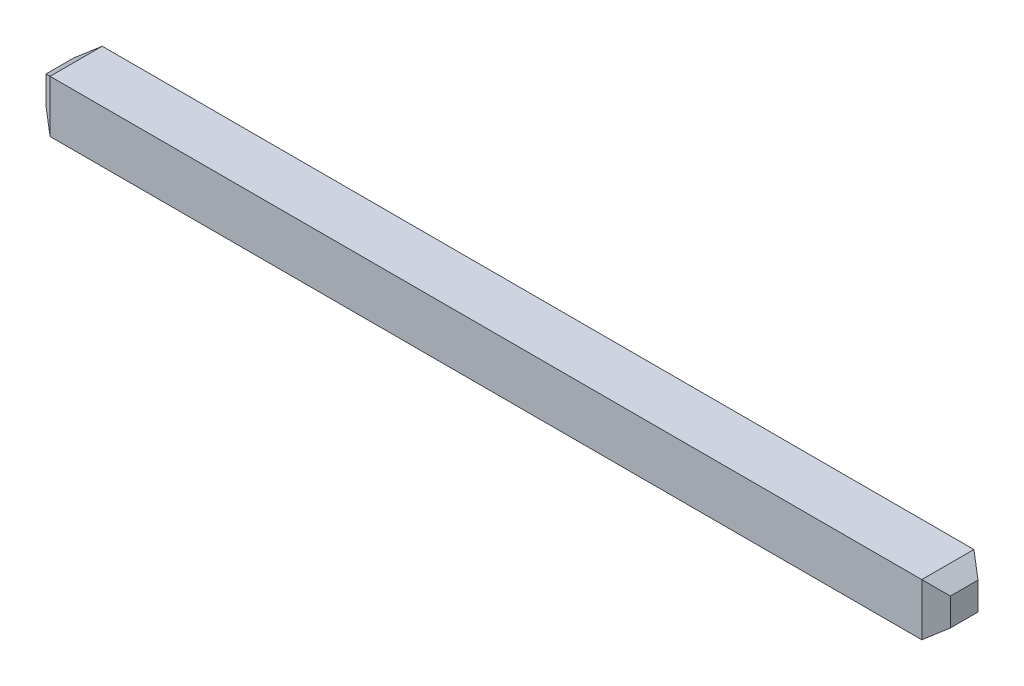
ISO-10303-21;
HEADER;
FILE_DESCRIPTION(('STEP AP214'),'2;1');
FILE_NAME('part.step','',(''),(''),'','','');
FILE_SCHEMA(('AUTOMOTIVE_DESIGN { 1 0 10303 214 1 1 1 1 }'));
ENDSEC;
DATA;
#1=APPLICATION_CONTEXT('core data for automotive mechanical design processes');
#2=APPLICATION_PROTOCOL_DEFINITION('international standard','automotive_design',2000,#1);
#3=PRODUCT_CONTEXT('',#1,'mechanical');
#4=PRODUCT('Part','Part','',(#3));
#5=PRODUCT_RELATED_PRODUCT_CATEGORY('part','',(#4));
#6=PRODUCT_DEFINITION_FORMATION('','',#4);
#7=PRODUCT_DEFINITION_CONTEXT('part definition',#1,'design');
#8=PRODUCT_DEFINITION('design','',#6,#7);
#9=PRODUCT_DEFINITION_SHAPE('','',#8);
#10=(LENGTH_UNIT() NAMED_UNIT(*) SI_UNIT(.MILLI.,.METRE.));
#11=(NAMED_UNIT(*) PLANE_ANGLE_UNIT() SI_UNIT($,.RADIAN.));
#12=(NAMED_UNIT(*) SI_UNIT($,.STERADIAN.) SOLID_ANGLE_UNIT());
#13=UNCERTAINTY_MEASURE_WITH_UNIT(LENGTH_MEASURE(1.E-05),#10,'distance_accuracy_value','');
#14=(GEOMETRIC_REPRESENTATION_CONTEXT(3) GLOBAL_UNCERTAINTY_ASSIGNED_CONTEXT((#13)) GLOBAL_UNIT_ASSIGNED_CONTEXT((#10,
#11,#12)) REPRESENTATION_CONTEXT('',''));
#15=CARTESIAN_POINT('',(0.,0.,0.));
#16=DIRECTION('',(0.,0.,1.));
#17=DIRECTION('',(1.,0.,0.));
#18=AXIS2_PLACEMENT_3D('',#15,#16,#17);
#19=CARTESIAN_POINT('',(-2.4,1.23,-49.775));
#20=DIRECTION('',(0.599999999990736,0.,0.800000000006948));
#21=DIRECTION('',(0.800000000006948,0.,-0.599999999990736));
#22=AXIS2_PLACEMENT_3D('',#19,#20,#21);
#23=PLANE('',#22);
#24=DIRECTION('',(0.,1.,0.));
#25=VECTOR('',#24,1.);
#26=CARTESIAN_POINT('',(-2.3,1.23,-49.85));
#27=LINE('',#26,#25);
#28=CARTESIAN_POINT('',(-2.29999999999956,1.55,-49.8499999999994));
#29=VERTEX_POINT('',#28);
#30=CARTESIAN_POINT('',(-2.29999999999957,0.909999999999898,-49.8499999999994));
#31=VERTEX_POINT('',#30);
#32=EDGE_CURVE('E101',#29,#31,#27,.F.);
#33=ORIENTED_EDGE('',*,*,#32,.T.);
#34=DIRECTION('',(-0.685994340569487,0.514495755428337,0.514495755427447));
#35=VECTOR('',#34,1.);
#36=CARTESIAN_POINT('',(-2.30000000000009,0.909999999999786,-49.85));
#37=LINE('',#36,#35);
#38=CARTESIAN_POINT('',(-2.50000000000021,1.06000000000001,-49.7000000000003));
#39=VERTEX_POINT('',#38);
#40=EDGE_CURVE('E85',#31,#39,#37,.T.);
#41=ORIENTED_EDGE('',*,*,#40,.T.);
#42=DIRECTION('',(0.,1.,0.));
#43=VECTOR('',#42,1.);
#44=CARTESIAN_POINT('',(-2.5,1.23,-49.7));
#45=LINE('',#44,#43);
#46=CARTESIAN_POINT('',(-2.50000000000043,1.4,-49.7000000000006));
#47=VERTEX_POINT('',#46);
#48=EDGE_CURVE('E79',#39,#47,#45,.T.);
#49=ORIENTED_EDGE('',*,*,#48,.T.);
#50=DIRECTION('',(-0.68599434057003,-0.514495755427523,0.514495755427537));
#51=VECTOR('',#50,1.);
#52=CARTESIAN_POINT('',(-2.3,1.55,-49.85));
#53=LINE('',#52,#51);
#54=EDGE_CURVE('E20',#29,#47,#53,.T.);
#55=ORIENTED_EDGE('',*,*,#54,.F.);
#56=EDGE_LOOP('',(#33,#41,#49,#55));
#57=FACE_BOUND('',#56,.T.);
#58=ADVANCED_FACE('F17',(#57),#23,.F.);
#59=CARTESIAN_POINT('',(8.5,1.23,-49.775));
#60=DIRECTION('',(-0.599999999990736,0.,0.800000000006948));
#61=DIRECTION('',(0.800000000006948,0.,0.599999999990736));
#62=AXIS2_PLACEMENT_3D('',#59,#60,#61);
#63=PLANE('',#62);
#64=DIRECTION('',(0.,1.,0.));
#65=VECTOR('',#64,1.);
#66=CARTESIAN_POINT('',(8.6,1.23,-49.7));
#67=LINE('',#66,#65);
#68=CARTESIAN_POINT('',(8.6000000000002,1.06000000000003,-49.7000000000003));
#69=VERTEX_POINT('',#68);
#70=CARTESIAN_POINT('',(8.60000000000043,1.4,-49.7000000000006));
#71=VERTEX_POINT('',#70);
#72=EDGE_CURVE('E113',#69,#71,#67,.T.);
#73=ORIENTED_EDGE('',*,*,#72,.F.);
#74=DIRECTION('',(-0.685994340569488,-0.514495755428337,-0.514495755427446));
#75=VECTOR('',#74,1.);
#76=CARTESIAN_POINT('',(8.59999999999996,1.06000000000005,-49.7));
#77=LINE('',#76,#75);
#78=CARTESIAN_POINT('',(8.39999999999958,0.909999999999884,-49.8499999999994));
#79=VERTEX_POINT('',#78);
#80=EDGE_CURVE('E108',#69,#79,#77,.T.);
#81=ORIENTED_EDGE('',*,*,#80,.T.);
#82=DIRECTION('',(0.,1.,0.));
#83=VECTOR('',#82,1.);
#84=CARTESIAN_POINT('',(8.4,1.23,-49.85));
#85=LINE('',#84,#83);
#86=CARTESIAN_POINT('',(8.39999999999956,1.55,-49.8499999999994));
#87=VERTEX_POINT('',#86);
#88=EDGE_CURVE('E99',#79,#87,#85,.T.);
#89=ORIENTED_EDGE('',*,*,#88,.T.);
#90=DIRECTION('',(-0.685994340570029,0.514495755427522,-0.51449575542754));
#91=VECTOR('',#90,1.);
#92=CARTESIAN_POINT('',(8.6,1.4,-49.7));
#93=LINE('',#92,#91);
#94=EDGE_CURVE('E116',#71,#87,#93,.T.);
#95=ORIENTED_EDGE('',*,*,#94,.F.);
#96=EDGE_LOOP('',(#73,#81,#89,#95));
#97=FACE_BOUND('',#96,.T.);
#98=ADVANCED_FACE('F214',(#97),#63,.F.);
#99=CARTESIAN_POINT('',(-2.4,1.475,-49.53));
#100=DIRECTION('',(-0.6,0.8,0.));
#101=DIRECTION('',(-0.8,-0.6,0.));
#102=AXIS2_PLACEMENT_3D('',#99,#100,#101);
#103=PLANE('',#102);
#104=DIRECTION('',(-0.685994340575951,-0.514495755427527,-0.514495755419639));
#105=VECTOR('',#104,1.);
#106=CARTESIAN_POINT('',(-2.29999999999914,1.55,-49.2100000000012));
#107=LINE('',#106,#105);
#108=CARTESIAN_POINT('',(-2.29999999999989,1.55,-49.2100000000001));
#109=VERTEX_POINT('',#108);
#110=CARTESIAN_POINT('',(-2.50000000000022,1.4,-49.3599999999997));
#111=VERTEX_POINT('',#110);
#112=EDGE_CURVE('E128',#109,#111,#107,.T.);
#113=ORIENTED_EDGE('',*,*,#112,.F.);
#114=DIRECTION('',(0.,0.,1.));
#115=VECTOR('',#114,1.);
#116=CARTESIAN_POINT('',(-2.3,1.55,-49.53));
#117=LINE('',#116,#115);
#118=EDGE_CURVE('E93',#29,#109,#117,.T.);
#119=ORIENTED_EDGE('',*,*,#118,.F.);
#120=ORIENTED_EDGE('',*,*,#54,.T.);
#121=DIRECTION('',(0.,0.,-1.));
#122=VECTOR('',#121,1.);
#123=CARTESIAN_POINT('',(-2.5,1.4,-49.53));
#124=LINE('',#123,#122);
#125=EDGE_CURVE('E87',#47,#111,#124,.F.);
#126=ORIENTED_EDGE('',*,*,#125,.T.);
#127=EDGE_LOOP('',(#113,#119,#120,#126));
#128=FACE_BOUND('',#127,.T.);
#129=ADVANCED_FACE('F90',(#128),#103,.T.);
#130=CARTESIAN_POINT('',(-2.5,1.23,-49.53));
#131=DIRECTION('',(1.,0.,0.));
#132=DIRECTION('',(0.,0.,-1.));
#133=AXIS2_PLACEMENT_3D('',#130,#131,#132);
#134=PLANE('',#133);
#135=DIRECTION('',(0.,1.,0.));
#136=VECTOR('',#135,1.);
#137=CARTESIAN_POINT('',(-2.50000000000087,1.23,-49.3599999999988));
#138=LINE('',#137,#136);
#139=CARTESIAN_POINT('',(-2.50000000000021,1.06000000000001,-49.3599999999997));
#140=VERTEX_POINT('',#139);
#141=EDGE_CURVE('E97',#111,#140,#138,.F.);
#142=ORIENTED_EDGE('',*,*,#141,.F.);
#143=ORIENTED_EDGE('',*,*,#125,.F.);
#144=ORIENTED_EDGE('',*,*,#48,.F.);
#145=DIRECTION('',(0.,0.,1.));
#146=VECTOR('',#145,1.);
#147=CARTESIAN_POINT('',(-2.49999999999996,1.06000000000005,-49.53));
#148=LINE('',#147,#146);
#149=EDGE_CURVE('E105',#39,#140,#148,.T.);
#150=ORIENTED_EDGE('',*,*,#149,.T.);
#151=EDGE_LOOP('',(#142,#143,#144,#150));
#152=FACE_BOUND('',#151,.T.);
#153=ADVANCED_FACE('F95',(#152),#134,.F.);
#154=CARTESIAN_POINT('',(3.05,1.23,-49.85));
#155=DIRECTION('',(0.,0.,1.));
#156=DIRECTION('',(1.,0.,0.));
#157=AXIS2_PLACEMENT_3D('',#154,#155,#156);
#158=PLANE('',#157);
#159=ORIENTED_EDGE('',*,*,#32,.F.);
#160=DIRECTION('',(1.,0.,0.));
#161=VECTOR('',#160,1.);
#162=CARTESIAN_POINT('',(3.05,1.55,-49.85));
#163=LINE('',#162,#161);
#164=EDGE_CURVE('E122',#87,#29,#163,.F.);
#165=ORIENTED_EDGE('',*,*,#164,.F.);
#166=ORIENTED_EDGE('',*,*,#88,.F.);
#167=DIRECTION('',(1.,0.,0.));
#168=VECTOR('',#167,1.);
#169=CARTESIAN_POINT('',(3.05,0.91,-49.85));
#170=LINE('',#169,#168);
#171=EDGE_CURVE('E136',#79,#31,#170,.F.);
#172=ORIENTED_EDGE('',*,*,#171,.T.);
#173=EDGE_LOOP('',(#159,#165,#166,#172));
#174=FACE_BOUND('',#173,.T.);
#175=ADVANCED_FACE('F182',(#174),#158,.F.);
#176=CARTESIAN_POINT('',(-2.4,0.9849999999999,-49.53));
#177=DIRECTION('',(0.600000000000912,0.799999999999316,0.));
#178=DIRECTION('',(-0.799999999999316,0.600000000000912,0.));
#179=AXIS2_PLACEMENT_3D('',#176,#177,#178);
#180=PLANE('',#179);
#181=DIRECTION('',(0.,0.,1.));
#182=VECTOR('',#181,1.);
#183=CARTESIAN_POINT('',(-2.3,0.91,-49.53));
#184=LINE('',#183,#182);
#185=CARTESIAN_POINT('',(-2.29999999999983,0.909999999999856,-49.2100000000003));
#186=VERTEX_POINT('',#185);
#187=EDGE_CURVE('E139',#31,#186,#184,.T.);
#188=ORIENTED_EDGE('',*,*,#187,.T.);
#189=DIRECTION('',(0.68599434057583,-0.514495755427779,0.514495755419548));
#190=VECTOR('',#189,1.);
#191=CARTESIAN_POINT('',(-2.50000000000087,1.06,-49.3599999999988));
#192=LINE('',#191,#190);
#193=EDGE_CURVE('E131',#140,#186,#192,.T.);
#194=ORIENTED_EDGE('',*,*,#193,.F.);
#195=ORIENTED_EDGE('',*,*,#149,.F.);
#196=ORIENTED_EDGE('',*,*,#40,.F.);
#197=EDGE_LOOP('',(#188,#194,#195,#196));
#198=FACE_BOUND('',#197,.T.);
#199=ADVANCED_FACE('F179',(#198),#180,.F.);
#200=CARTESIAN_POINT('',(8.5,0.9849999999999,-49.53));
#201=DIRECTION('',(-0.600000000000912,0.799999999999316,0.));
#202=DIRECTION('',(-0.799999999999316,-0.600000000000912,0.));
#203=AXIS2_PLACEMENT_3D('',#200,#201,#202);
#204=PLANE('',#203);
#205=DIRECTION('',(0.,0.,-1.));
#206=VECTOR('',#205,1.);
#207=CARTESIAN_POINT('',(8.6,1.06,-49.53));
#208=LINE('',#207,#206);
#209=CARTESIAN_POINT('',(8.6000000000002,1.06000000000003,-49.3599999999997));
#210=VERTEX_POINT('',#209);
#211=EDGE_CURVE('E110',#210,#69,#208,.T.);
#212=ORIENTED_EDGE('',*,*,#211,.F.);
#213=DIRECTION('',(0.68599434057583,0.514495755427779,-0.514495755419548));
#214=VECTOR('',#213,1.);
#215=CARTESIAN_POINT('',(8.39999999999914,0.9099999999999,-49.2100000000012));
#216=LINE('',#215,#214);
#217=CARTESIAN_POINT('',(8.39999999999993,0.909999999999868,-49.2100000000001));
#218=VERTEX_POINT('',#217);
#219=EDGE_CURVE('E35',#218,#210,#216,.T.);
#220=ORIENTED_EDGE('',*,*,#219,.F.);
#221=DIRECTION('',(0.,0.,1.));
#222=VECTOR('',#221,1.);
#223=CARTESIAN_POINT('',(8.4,0.91,-49.53));
#224=LINE('',#223,#222);
#225=EDGE_CURVE('E134',#218,#79,#224,.F.);
#226=ORIENTED_EDGE('',*,*,#225,.T.);
#227=ORIENTED_EDGE('',*,*,#80,.F.);
#228=EDGE_LOOP('',(#212,#220,#226,#227));
#229=FACE_BOUND('',#228,.T.);
#230=ADVANCED_FACE('F181',(#229),#204,.F.);
#231=CARTESIAN_POINT('',(8.6,1.23,-49.53));
#232=DIRECTION('',(1.,0.,0.));
#233=DIRECTION('',(0.,0.,-1.));
#234=AXIS2_PLACEMENT_3D('',#231,#232,#233);
#235=PLANE('',#234);
#236=ORIENTED_EDGE('',*,*,#72,.T.);
#237=DIRECTION('',(0.,0.,1.));
#238=VECTOR('',#237,1.);
#239=CARTESIAN_POINT('',(8.6,1.4,-49.53));
#240=LINE('',#239,#238);
#241=CARTESIAN_POINT('',(8.60000000000022,1.4,-49.3599999999997));
#242=VERTEX_POINT('',#241);
#243=EDGE_CURVE('E119',#242,#71,#240,.F.);
#244=ORIENTED_EDGE('',*,*,#243,.F.);
#245=DIRECTION('',(0.,1.,0.));
#246=VECTOR('',#245,1.);
#247=CARTESIAN_POINT('',(8.60000000000087,1.23,-49.3599999999988));
#248=LINE('',#247,#246);
#249=EDGE_CURVE('E142',#210,#242,#248,.T.);
#250=ORIENTED_EDGE('',*,*,#249,.F.);
#251=ORIENTED_EDGE('',*,*,#211,.T.);
#252=EDGE_LOOP('',(#236,#244,#250,#251));
#253=FACE_BOUND('',#252,.T.);
#254=ADVANCED_FACE('F189',(#253),#235,.T.);
#255=CARTESIAN_POINT('',(8.5,1.475,-49.53));
#256=DIRECTION('',(0.6,0.8,0.));
#257=DIRECTION('',(-0.8,0.6,0.));
#258=AXIS2_PLACEMENT_3D('',#255,#256,#257);
#259=PLANE('',#258);
#260=DIRECTION('',(-0.685994340575951,0.514495755427527,0.514495755419639));
#261=VECTOR('',#260,1.);
#262=CARTESIAN_POINT('',(8.60000000000087,1.4,-49.3599999999988));
#263=LINE('',#262,#261);
#264=CARTESIAN_POINT('',(8.39999999999989,1.55,-49.2100000000001));
#265=VERTEX_POINT('',#264);
#266=EDGE_CURVE('E145',#242,#265,#263,.T.);
#267=ORIENTED_EDGE('',*,*,#266,.F.);
#268=ORIENTED_EDGE('',*,*,#243,.T.);
#269=ORIENTED_EDGE('',*,*,#94,.T.);
#270=DIRECTION('',(0.,0.,1.));
#271=VECTOR('',#270,1.);
#272=CARTESIAN_POINT('',(8.4,1.55,-49.53));
#273=LINE('',#272,#271);
#274=EDGE_CURVE('E125',#265,#87,#273,.F.);
#275=ORIENTED_EDGE('',*,*,#274,.F.);
#276=EDGE_LOOP('',(#267,#268,#269,#275));
#277=FACE_BOUND('',#276,.T.);
#278=ADVANCED_FACE('F170',(#277),#259,.T.);
#279=CARTESIAN_POINT('',(3.05,1.55,-49.53));
#280=DIRECTION('',(0.,1.,0.));
#281=DIRECTION('',(0.,0.,1.));
#282=AXIS2_PLACEMENT_3D('',#279,#280,#281);
#283=PLANE('',#282);
#284=DIRECTION('',(1.,0.,0.));
#285=VECTOR('',#284,1.);
#286=CARTESIAN_POINT('',(3.05,1.55,-49.21));
#287=LINE('',#286,#285);
#288=EDGE_CURVE('E148',#265,#109,#287,.F.);
#289=ORIENTED_EDGE('',*,*,#288,.F.);
#290=ORIENTED_EDGE('',*,*,#274,.T.);
#291=ORIENTED_EDGE('',*,*,#164,.T.);
#292=ORIENTED_EDGE('',*,*,#118,.T.);
#293=EDGE_LOOP('',(#289,#290,#291,#292));
#294=FACE_BOUND('',#293,.T.);
#295=ADVANCED_FACE('F173',(#294),#283,.T.);
#296=CARTESIAN_POINT('',(-2.4,1.23,-49.285));
#297=DIRECTION('',(-0.5999999999908,0.,0.8000000000069));
#298=DIRECTION('',(0.8000000000069,0.,0.5999999999908));
#299=AXIS2_PLACEMENT_3D('',#296,#297,#298);
#300=PLANE('',#299);
#301=ORIENTED_EDGE('',*,*,#193,.T.);
#302=DIRECTION('',(0.,1.,0.));
#303=VECTOR('',#302,1.);
#304=CARTESIAN_POINT('',(-2.3,1.23,-49.21));
#305=LINE('',#304,#303);
#306=EDGE_CURVE('E151',#109,#186,#305,.F.);
#307=ORIENTED_EDGE('',*,*,#306,.F.);
#308=ORIENTED_EDGE('',*,*,#112,.T.);
#309=ORIENTED_EDGE('',*,*,#141,.T.);
#310=EDGE_LOOP('',(#301,#307,#308,#309));
#311=FACE_BOUND('',#310,.T.);
#312=ADVANCED_FACE('F176',(#311),#300,.T.);
#313=CARTESIAN_POINT('',(3.05,0.91,-49.53));
#314=DIRECTION('',(0.,1.,0.));
#315=DIRECTION('',(0.,0.,1.));
#316=AXIS2_PLACEMENT_3D('',#313,#314,#315);
#317=PLANE('',#316);
#318=ORIENTED_EDGE('',*,*,#187,.F.);
#319=ORIENTED_EDGE('',*,*,#171,.F.);
#320=ORIENTED_EDGE('',*,*,#225,.F.);
#321=DIRECTION('',(1.,0.,0.));
#322=VECTOR('',#321,1.);
#323=CARTESIAN_POINT('',(3.05,0.9099999999999,-49.21));
#324=LINE('',#323,#322);
#325=EDGE_CURVE('E26',#186,#218,#324,.T.);
#326=ORIENTED_EDGE('',*,*,#325,.F.);
#327=EDGE_LOOP('',(#318,#319,#320,#326));
#328=FACE_BOUND('',#327,.T.);
#329=ADVANCED_FACE('F162',(#328),#317,.F.);
#330=CARTESIAN_POINT('',(8.5,1.23,-49.285));
#331=DIRECTION('',(0.5999999999908,0.,0.8000000000069));
#332=DIRECTION('',(0.8000000000069,0.,-0.5999999999908));
#333=AXIS2_PLACEMENT_3D('',#330,#331,#332);
#334=PLANE('',#333);
#335=ORIENTED_EDGE('',*,*,#266,.T.);
#336=DIRECTION('',(0.,1.,0.));
#337=VECTOR('',#336,1.);
#338=CARTESIAN_POINT('',(8.4,1.23,-49.21));
#339=LINE('',#338,#337);
#340=EDGE_CURVE('E11',#218,#265,#339,.T.);
#341=ORIENTED_EDGE('',*,*,#340,.F.);
#342=ORIENTED_EDGE('',*,*,#219,.T.);
#343=ORIENTED_EDGE('',*,*,#249,.T.);
#344=EDGE_LOOP('',(#335,#341,#342,#343));
#345=FACE_BOUND('',#344,.T.);
#346=ADVANCED_FACE('F166',(#345),#334,.T.);
#347=CARTESIAN_POINT('',(3.05,1.23,-49.21));
#348=DIRECTION('',(0.,0.,1.));
#349=DIRECTION('',(1.,0.,0.));
#350=AXIS2_PLACEMENT_3D('',#347,#348,#349);
#351=PLANE('',#350);
#352=ORIENTED_EDGE('',*,*,#325,.T.);
#353=ORIENTED_EDGE('',*,*,#340,.T.);
#354=ORIENTED_EDGE('',*,*,#288,.T.);
#355=ORIENTED_EDGE('',*,*,#306,.T.);
#356=EDGE_LOOP('',(#352,#353,#354,#355));
#357=FACE_BOUND('',#356,.T.);
#358=ADVANCED_FACE('F157',(#357),#351,.T.);
#359=CLOSED_SHELL('',(#58,#98,#129,#153,#175,#199,#230,#254,#278,#295,#312,#329,#346,#358));
#360=MANIFOLD_SOLID_BREP('B1',#359);
#361=ADVANCED_BREP_SHAPE_REPRESENTATION('',(#18,#360),#14);
#362=SHAPE_DEFINITION_REPRESENTATION(#9,#361);
ENDSEC;
END-ISO-10303-21;
